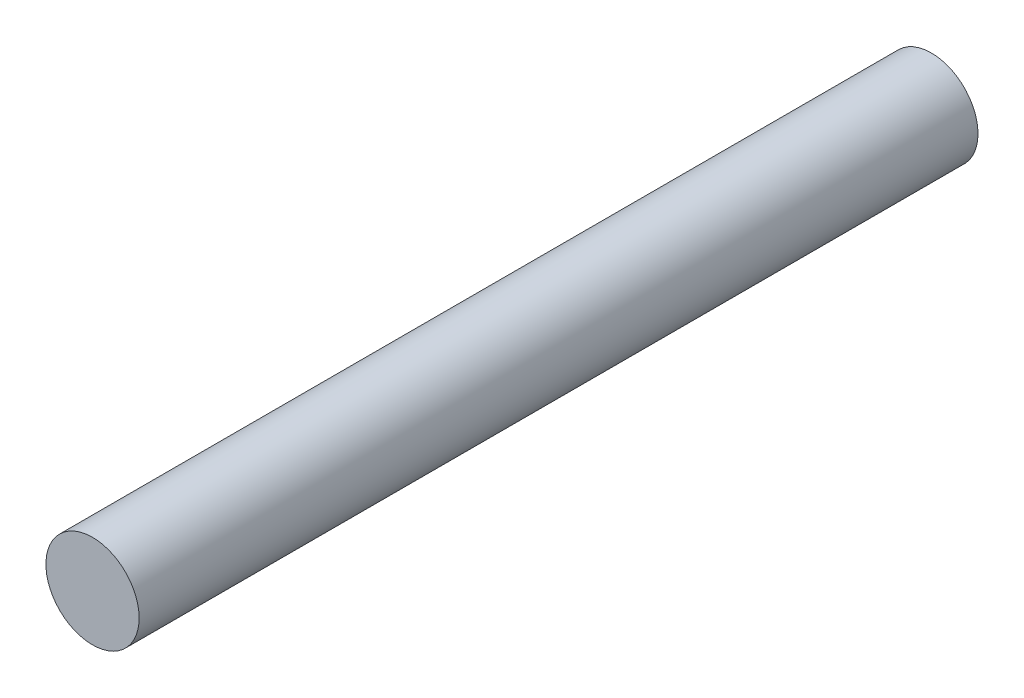
ISO-10303-21;
HEADER;
FILE_DESCRIPTION(('STEP AP214'),'2;1');
FILE_NAME('part.step','',(''),(''),'','','');
FILE_SCHEMA(('AUTOMOTIVE_DESIGN { 1 0 10303 214 1 1 1 1 }'));
ENDSEC;
DATA;
#1=APPLICATION_CONTEXT('core data for automotive mechanical design processes');
#2=APPLICATION_PROTOCOL_DEFINITION('international standard','automotive_design',2000,#1);
#3=PRODUCT_CONTEXT('',#1,'mechanical');
#4=PRODUCT('Part','Part','',(#3));
#5=PRODUCT_RELATED_PRODUCT_CATEGORY('part','',(#4));
#6=PRODUCT_DEFINITION_FORMATION('','',#4);
#7=PRODUCT_DEFINITION_CONTEXT('part definition',#1,'design');
#8=PRODUCT_DEFINITION('design','',#6,#7);
#9=PRODUCT_DEFINITION_SHAPE('','',#8);
#10=(LENGTH_UNIT() NAMED_UNIT(*) SI_UNIT(.MILLI.,.METRE.));
#11=(NAMED_UNIT(*) PLANE_ANGLE_UNIT() SI_UNIT($,.RADIAN.));
#12=(NAMED_UNIT(*) SI_UNIT($,.STERADIAN.) SOLID_ANGLE_UNIT());
#13=UNCERTAINTY_MEASURE_WITH_UNIT(LENGTH_MEASURE(1.E-05),#10,'distance_accuracy_value','');
#14=(GEOMETRIC_REPRESENTATION_CONTEXT(3) GLOBAL_UNCERTAINTY_ASSIGNED_CONTEXT((#13)) GLOBAL_UNIT_ASSIGNED_CONTEXT((#10,
#11,#12)) REPRESENTATION_CONTEXT('',''));
#15=CARTESIAN_POINT('',(0.,0.,0.));
#16=DIRECTION('',(0.,0.,1.));
#17=DIRECTION('',(1.,0.,0.));
#18=AXIS2_PLACEMENT_3D('',#15,#16,#17);
#19=CARTESIAN_POINT('',(0.,0.,72.));
#20=DIRECTION('',(0.,0.,-1.));
#21=DIRECTION('',(-1.,0.,0.));
#22=AXIS2_PLACEMENT_3D('',#19,#20,#21);
#23=CYLINDRICAL_SURFACE('',#22,4.);
#24=CARTESIAN_POINT('',(0.,0.,72.));
#25=DIRECTION('',(0.,0.,1.));
#26=DIRECTION('',(1.,0.,0.));
#27=AXIS2_PLACEMENT_3D('',#24,#25,#26);
#28=CIRCLE('',#27,4.);
#29=CARTESIAN_POINT('',(4.,0.,72.));
#30=VERTEX_POINT('',#29);
#31=EDGE_CURVE('E12',#30,#30,#28,.T.);
#32=ORIENTED_EDGE('',*,*,#31,.F.);
#33=EDGE_LOOP('',(#32));
#34=FACE_BOUND('',#33,.T.);
#35=CARTESIAN_POINT('',(0.,0.,0.));
#36=DIRECTION('',(0.,0.,1.));
#37=DIRECTION('',(1.,0.,0.));
#38=AXIS2_PLACEMENT_3D('',#35,#36,#37);
#39=CIRCLE('',#38,4.);
#40=CARTESIAN_POINT('',(4.,0.,0.));
#41=VERTEX_POINT('',#40);
#42=EDGE_CURVE('E43',#41,#41,#39,.T.);
#43=ORIENTED_EDGE('',*,*,#42,.T.);
#44=EDGE_LOOP('',(#43));
#45=FACE_BOUND('',#44,.T.);
#46=ADVANCED_FACE('F40',(#34,#45),#23,.T.);
#47=CARTESIAN_POINT('',(0.,0.,72.));
#48=DIRECTION('',(0.,0.,1.));
#49=DIRECTION('',(1.,0.,0.));
#50=AXIS2_PLACEMENT_3D('',#47,#48,#49);
#51=PLANE('',#50);
#52=ORIENTED_EDGE('',*,*,#31,.T.);
#53=EDGE_LOOP('',(#52));
#54=FACE_BOUND('',#53,.T.);
#55=ADVANCED_FACE('F55',(#54),#51,.T.);
#56=CARTESIAN_POINT('',(0.,0.,0.));
#57=DIRECTION('',(0.,0.,1.));
#58=DIRECTION('',(1.,0.,0.));
#59=AXIS2_PLACEMENT_3D('',#56,#57,#58);
#60=PLANE('',#59);
#61=ORIENTED_EDGE('',*,*,#42,.F.);
#62=EDGE_LOOP('',(#61));
#63=FACE_BOUND('',#62,.T.);
#64=ADVANCED_FACE('F53',(#63),#60,.F.);
#65=CLOSED_SHELL('',(#46,#55,#64));
#66=MANIFOLD_SOLID_BREP('B2',#65);
#67=ADVANCED_BREP_SHAPE_REPRESENTATION('',(#18,#66),#14);
#68=SHAPE_DEFINITION_REPRESENTATION(#9,#67);
ENDSEC;
END-ISO-10303-21;
